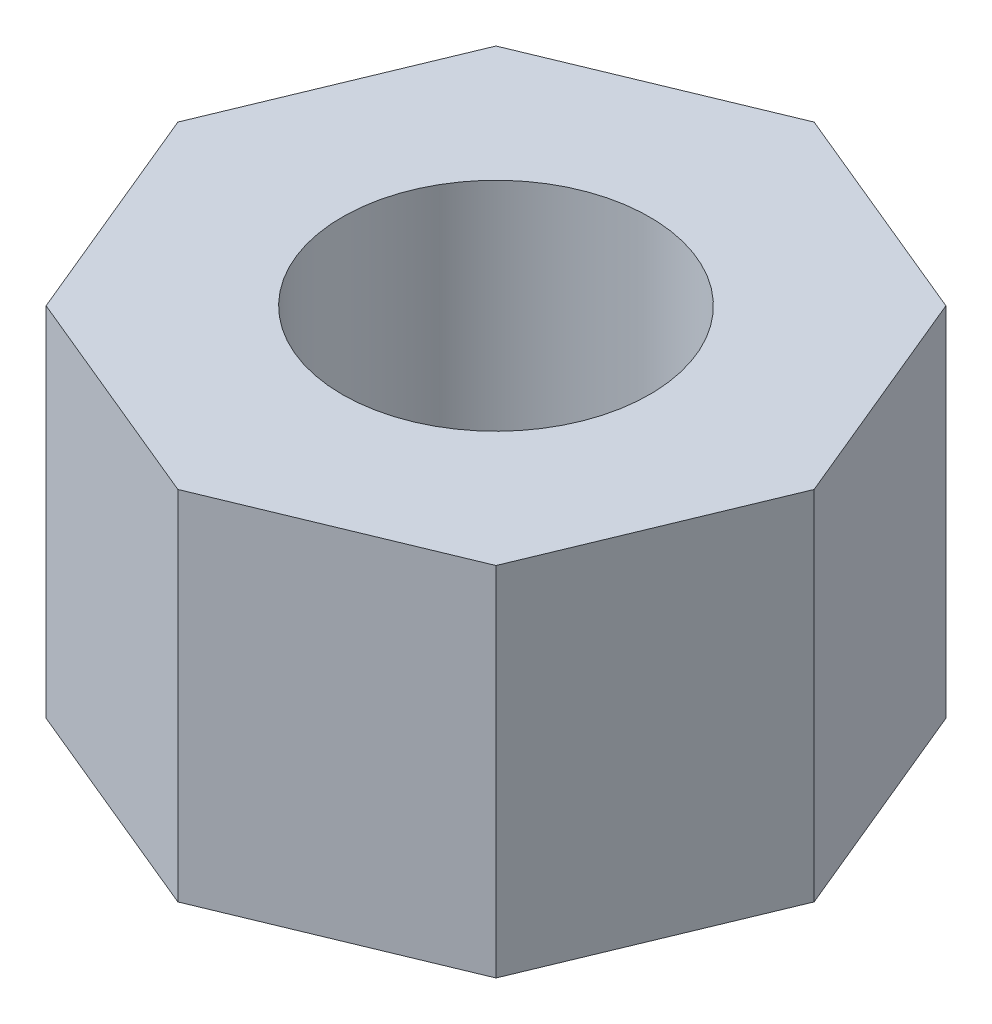
ISO-10303-21;
HEADER;
FILE_DESCRIPTION(('STEP AP214'),'2;1');
FILE_NAME('part.step','',(''),(''),'','','');
FILE_SCHEMA(('AUTOMOTIVE_DESIGN { 1 0 10303 214 1 1 1 1 }'));
ENDSEC;
DATA;
#1=APPLICATION_CONTEXT('core data for automotive mechanical design processes');
#2=APPLICATION_PROTOCOL_DEFINITION('international standard','automotive_design',2000,#1);
#3=PRODUCT_CONTEXT('',#1,'mechanical');
#4=PRODUCT('Part','Part','',(#3));
#5=PRODUCT_RELATED_PRODUCT_CATEGORY('part','',(#4));
#6=PRODUCT_DEFINITION_FORMATION('','',#4);
#7=PRODUCT_DEFINITION_CONTEXT('part definition',#1,'design');
#8=PRODUCT_DEFINITION('design','',#6,#7);
#9=PRODUCT_DEFINITION_SHAPE('','',#8);
#10=(LENGTH_UNIT() NAMED_UNIT(*) SI_UNIT(.MILLI.,.METRE.));
#11=(NAMED_UNIT(*) PLANE_ANGLE_UNIT() SI_UNIT($,.RADIAN.));
#12=(NAMED_UNIT(*) SI_UNIT($,.STERADIAN.) SOLID_ANGLE_UNIT());
#13=UNCERTAINTY_MEASURE_WITH_UNIT(LENGTH_MEASURE(1.E-05),#10,'distance_accuracy_value','');
#14=(GEOMETRIC_REPRESENTATION_CONTEXT(3) GLOBAL_UNCERTAINTY_ASSIGNED_CONTEXT((#13)) GLOBAL_UNIT_ASSIGNED_CONTEXT((#10,
#11,#12)) REPRESENTATION_CONTEXT('',''));
#15=CARTESIAN_POINT('',(0.,0.,0.));
#16=DIRECTION('',(0.,0.,1.));
#17=DIRECTION('',(1.,0.,0.));
#18=AXIS2_PLACEMENT_3D('',#15,#16,#17);
#19=CARTESIAN_POINT('',(2.48744231037308,7.9,6.00521696132337));
#20=DIRECTION('',(-0.38268343236509,0.,-0.923879532511287));
#21=DIRECTION('',(-0.923879532511287,0.,0.38268343236509));
#22=AXIS2_PLACEMENT_3D('',#19,#20,#21);
#23=PLANE('',#22);
#24=DIRECTION('',(0.923879532511287,0.,-0.38268343236509));
#25=VECTOR('',#24,1.);
#26=CARTESIAN_POINT('',(2.48744231037308,0.,6.00521696132337));
#27=LINE('',#26,#25);
#28=CARTESIAN_POINT('',(0.,0.,7.03554930190056));
#29=VERTEX_POINT('',#28);
#30=CARTESIAN_POINT('',(4.97488462074616,0.,4.97488462074617));
#31=VERTEX_POINT('',#30);
#32=EDGE_CURVE('E135',#29,#31,#27,.T.);
#33=ORIENTED_EDGE('',*,*,#32,.T.);
#34=DIRECTION('',(0.,-1.,0.));
#35=VECTOR('',#34,1.);
#36=CARTESIAN_POINT('',(4.97488462074616,7.9,4.97488462074617));
#37=LINE('',#36,#35);
#38=CARTESIAN_POINT('',(4.97488462074616,7.9,4.97488462074617));
#39=VERTEX_POINT('',#38);
#40=EDGE_CURVE('E11',#39,#31,#37,.T.);
#41=ORIENTED_EDGE('',*,*,#40,.F.);
#42=DIRECTION('',(0.923879532511287,0.,-0.38268343236509));
#43=VECTOR('',#42,1.);
#44=CARTESIAN_POINT('',(2.48744231037308,7.9,6.00521696132337));
#45=LINE('',#44,#43);
#46=CARTESIAN_POINT('',(0.,7.9,7.03554930190056));
#47=VERTEX_POINT('',#46);
#48=EDGE_CURVE('E181',#47,#39,#45,.T.);
#49=ORIENTED_EDGE('',*,*,#48,.F.);
#50=DIRECTION('',(0.,-1.,0.));
#51=VECTOR('',#50,1.);
#52=CARTESIAN_POINT('',(0.,7.9,7.03554930190056));
#53=LINE('',#52,#51);
#54=EDGE_CURVE('E128',#47,#29,#53,.T.);
#55=ORIENTED_EDGE('',*,*,#54,.T.);
#56=EDGE_LOOP('',(#33,#41,#49,#55));
#57=FACE_BOUND('',#56,.T.);
#58=ADVANCED_FACE('F35',(#57),#23,.F.);
#59=CARTESIAN_POINT('',(6.00521696132336,7.9,2.48744231037308));
#60=DIRECTION('',(-0.923879532511287,0.,-0.38268343236509));
#61=DIRECTION('',(-0.38268343236509,0.,0.923879532511287));
#62=AXIS2_PLACEMENT_3D('',#59,#60,#61);
#63=PLANE('',#62);
#64=DIRECTION('',(0.38268343236509,0.,-0.923879532511287));
#65=VECTOR('',#64,1.);
#66=CARTESIAN_POINT('',(6.00521696132336,0.,2.48744231037308));
#67=LINE('',#66,#65);
#68=CARTESIAN_POINT('',(7.03554930190056,0.,0.));
#69=VERTEX_POINT('',#68);
#70=EDGE_CURVE('E138',#31,#69,#67,.T.);
#71=ORIENTED_EDGE('',*,*,#70,.T.);
#72=DIRECTION('',(0.,-1.,0.));
#73=VECTOR('',#72,1.);
#74=CARTESIAN_POINT('',(7.03554930190056,7.9,0.));
#75=LINE('',#74,#73);
#76=CARTESIAN_POINT('',(7.03554930190056,7.9,0.));
#77=VERTEX_POINT('',#76);
#78=EDGE_CURVE('E44',#77,#69,#75,.T.);
#79=ORIENTED_EDGE('',*,*,#78,.F.);
#80=DIRECTION('',(0.38268343236509,0.,-0.923879532511287));
#81=VECTOR('',#80,1.);
#82=CARTESIAN_POINT('',(6.00521696132336,7.9,2.48744231037308));
#83=LINE('',#82,#81);
#84=EDGE_CURVE('E95',#39,#77,#83,.T.);
#85=ORIENTED_EDGE('',*,*,#84,.F.);
#86=ORIENTED_EDGE('',*,*,#40,.T.);
#87=EDGE_LOOP('',(#71,#79,#85,#86));
#88=FACE_BOUND('',#87,.T.);
#89=ADVANCED_FACE('F199',(#88),#63,.F.);
#90=CARTESIAN_POINT('',(6.00521696132336,7.9,-2.48744231037308));
#91=DIRECTION('',(-0.923879532511287,0.,0.38268343236509));
#92=DIRECTION('',(0.38268343236509,0.,0.923879532511287));
#93=AXIS2_PLACEMENT_3D('',#90,#91,#92);
#94=PLANE('',#93);
#95=DIRECTION('',(-0.38268343236509,0.,-0.923879532511287));
#96=VECTOR('',#95,1.);
#97=CARTESIAN_POINT('',(6.00521696132336,0.,-2.48744231037308));
#98=LINE('',#97,#96);
#99=CARTESIAN_POINT('',(4.97488462074617,0.,-4.97488462074616));
#100=VERTEX_POINT('',#99);
#101=EDGE_CURVE('E140',#69,#100,#98,.T.);
#102=ORIENTED_EDGE('',*,*,#101,.T.);
#103=DIRECTION('',(0.,-1.,0.));
#104=VECTOR('',#103,1.);
#105=CARTESIAN_POINT('',(4.97488462074617,7.9,-4.97488462074616));
#106=LINE('',#105,#104);
#107=CARTESIAN_POINT('',(4.97488462074617,7.9,-4.97488462074616));
#108=VERTEX_POINT('',#107);
#109=EDGE_CURVE('E156',#108,#100,#106,.T.);
#110=ORIENTED_EDGE('',*,*,#109,.F.);
#111=DIRECTION('',(-0.38268343236509,0.,-0.923879532511287));
#112=VECTOR('',#111,1.);
#113=CARTESIAN_POINT('',(6.00521696132336,7.9,-2.48744231037308));
#114=LINE('',#113,#112);
#115=EDGE_CURVE('E164',#77,#108,#114,.T.);
#116=ORIENTED_EDGE('',*,*,#115,.F.);
#117=ORIENTED_EDGE('',*,*,#78,.T.);
#118=EDGE_LOOP('',(#102,#110,#116,#117));
#119=FACE_BOUND('',#118,.T.);
#120=ADVANCED_FACE('F162',(#119),#94,.F.);
#121=CARTESIAN_POINT('',(2.48744231037304,7.9,-6.00521696132336));
#122=DIRECTION('',(-0.382683432365085,0.,0.923879532511289));
#123=DIRECTION('',(0.923879532511289,0.,0.382683432365085));
#124=AXIS2_PLACEMENT_3D('',#121,#122,#123);
#125=PLANE('',#124);
#126=DIRECTION('',(-0.923879532511289,0.,-0.382683432365085));
#127=VECTOR('',#126,1.);
#128=CARTESIAN_POINT('',(2.48744231037304,0.,-6.00521696132336));
#129=LINE('',#128,#127);
#130=CARTESIAN_POINT('',(0.,0.,-7.03554930190056));
#131=VERTEX_POINT('',#130);
#132=EDGE_CURVE('E142',#100,#131,#129,.T.);
#133=ORIENTED_EDGE('',*,*,#132,.T.);
#134=DIRECTION('',(0.,-1.,0.));
#135=VECTOR('',#134,1.);
#136=CARTESIAN_POINT('',(0.,7.9,-7.03554930190056));
#137=LINE('',#136,#135);
#138=CARTESIAN_POINT('',(0.,7.9,-7.03554930190056));
#139=VERTEX_POINT('',#138);
#140=EDGE_CURVE('E153',#139,#131,#137,.T.);
#141=ORIENTED_EDGE('',*,*,#140,.F.);
#142=DIRECTION('',(-0.923879532511289,0.,-0.382683432365085));
#143=VECTOR('',#142,1.);
#144=CARTESIAN_POINT('',(2.48744231037304,7.9,-6.00521696132336));
#145=LINE('',#144,#143);
#146=EDGE_CURVE('E176',#108,#139,#145,.T.);
#147=ORIENTED_EDGE('',*,*,#146,.F.);
#148=ORIENTED_EDGE('',*,*,#109,.T.);
#149=EDGE_LOOP('',(#133,#141,#147,#148));
#150=FACE_BOUND('',#149,.T.);
#151=ADVANCED_FACE('F172',(#150),#125,.F.);
#152=CARTESIAN_POINT('',(-2.48744231037313,7.9,-6.00521696132336));
#153=DIRECTION('',(0.382683432365097,0.,0.923879532511284));
#154=DIRECTION('',(0.923879532511284,0.,-0.382683432365097));
#155=AXIS2_PLACEMENT_3D('',#152,#153,#154);
#156=PLANE('',#155);
#157=DIRECTION('',(-0.923879532511284,0.,0.382683432365097));
#158=VECTOR('',#157,1.);
#159=CARTESIAN_POINT('',(-2.48744231037313,0.,-6.00521696132336));
#160=LINE('',#159,#158);
#161=CARTESIAN_POINT('',(-4.97488462074616,0.,-4.97488462074616));
#162=VERTEX_POINT('',#161);
#163=EDGE_CURVE('E144',#131,#162,#160,.T.);
#164=ORIENTED_EDGE('',*,*,#163,.T.);
#165=DIRECTION('',(0.,-1.,0.));
#166=VECTOR('',#165,1.);
#167=CARTESIAN_POINT('',(-4.97488462074616,7.9,-4.97488462074616));
#168=LINE('',#167,#166);
#169=CARTESIAN_POINT('',(-4.97488462074616,7.9,-4.97488462074616));
#170=VERTEX_POINT('',#169);
#171=EDGE_CURVE('E123',#170,#162,#168,.T.);
#172=ORIENTED_EDGE('',*,*,#171,.F.);
#173=DIRECTION('',(-0.923879532511284,0.,0.382683432365097));
#174=VECTOR('',#173,1.);
#175=CARTESIAN_POINT('',(-2.48744231037313,7.9,-6.00521696132336));
#176=LINE('',#175,#174);
#177=EDGE_CURVE('E114',#139,#170,#176,.T.);
#178=ORIENTED_EDGE('',*,*,#177,.F.);
#179=ORIENTED_EDGE('',*,*,#140,.T.);
#180=EDGE_LOOP('',(#164,#172,#178,#179));
#181=FACE_BOUND('',#180,.T.);
#182=ADVANCED_FACE('F175',(#181),#156,.F.);
#183=CARTESIAN_POINT('',(-6.00521696132336,7.9,-2.48744231037309));
#184=DIRECTION('',(0.923879532511287,0.,0.38268343236509));
#185=DIRECTION('',(0.38268343236509,0.,-0.923879532511287));
#186=AXIS2_PLACEMENT_3D('',#183,#184,#185);
#187=PLANE('',#186);
#188=DIRECTION('',(-0.38268343236509,0.,0.923879532511287));
#189=VECTOR('',#188,1.);
#190=CARTESIAN_POINT('',(-6.00521696132336,0.,-2.48744231037309));
#191=LINE('',#190,#189);
#192=CARTESIAN_POINT('',(-7.03554930190056,0.,0.));
#193=VERTEX_POINT('',#192);
#194=EDGE_CURVE('E122',#162,#193,#191,.T.);
#195=ORIENTED_EDGE('',*,*,#194,.T.);
#196=DIRECTION('',(0.,-1.,0.));
#197=VECTOR('',#196,1.);
#198=CARTESIAN_POINT('',(-7.03554930190056,7.9,0.));
#199=LINE('',#198,#197);
#200=CARTESIAN_POINT('',(-7.03554930190056,7.9,0.));
#201=VERTEX_POINT('',#200);
#202=EDGE_CURVE('E119',#201,#193,#199,.T.);
#203=ORIENTED_EDGE('',*,*,#202,.F.);
#204=DIRECTION('',(-0.38268343236509,0.,0.923879532511287));
#205=VECTOR('',#204,1.);
#206=CARTESIAN_POINT('',(-6.00521696132336,7.9,-2.48744231037309));
#207=LINE('',#206,#205);
#208=EDGE_CURVE('E108',#170,#201,#207,.T.);
#209=ORIENTED_EDGE('',*,*,#208,.F.);
#210=ORIENTED_EDGE('',*,*,#171,.T.);
#211=EDGE_LOOP('',(#195,#203,#209,#210));
#212=FACE_BOUND('',#211,.T.);
#213=ADVANCED_FACE('F120',(#212),#187,.F.);
#214=CARTESIAN_POINT('',(-6.00521696132337,7.9,2.48744231037308));
#215=DIRECTION('',(0.923879532511287,0.,-0.38268343236509));
#216=DIRECTION('',(-0.38268343236509,0.,-0.923879532511287));
#217=AXIS2_PLACEMENT_3D('',#214,#215,#216);
#218=PLANE('',#217);
#219=DIRECTION('',(0.38268343236509,0.,0.923879532511287));
#220=VECTOR('',#219,1.);
#221=CARTESIAN_POINT('',(-6.00521696132337,0.,2.48744231037308));
#222=LINE('',#221,#220);
#223=CARTESIAN_POINT('',(-4.97488462074617,0.,4.97488462074616));
#224=VERTEX_POINT('',#223);
#225=EDGE_CURVE('E81',#193,#224,#222,.T.);
#226=ORIENTED_EDGE('',*,*,#225,.T.);
#227=DIRECTION('',(0.,-1.,0.));
#228=VECTOR('',#227,1.);
#229=CARTESIAN_POINT('',(-4.97488462074617,7.9,4.97488462074616));
#230=LINE('',#229,#228);
#231=CARTESIAN_POINT('',(-4.97488462074617,7.9,4.97488462074616));
#232=VERTEX_POINT('',#231);
#233=EDGE_CURVE('E124',#232,#224,#230,.T.);
#234=ORIENTED_EDGE('',*,*,#233,.F.);
#235=DIRECTION('',(0.38268343236509,0.,0.923879532511287));
#236=VECTOR('',#235,1.);
#237=CARTESIAN_POINT('',(-6.00521696132337,7.9,2.48744231037308));
#238=LINE('',#237,#236);
#239=EDGE_CURVE('E112',#201,#232,#238,.T.);
#240=ORIENTED_EDGE('',*,*,#239,.F.);
#241=ORIENTED_EDGE('',*,*,#202,.T.);
#242=EDGE_LOOP('',(#226,#234,#240,#241));
#243=FACE_BOUND('',#242,.T.);
#244=ADVANCED_FACE('F126',(#243),#218,.F.);
#245=CARTESIAN_POINT('',(0.,7.9,0.));
#246=DIRECTION('',(0.,-1.,0.));
#247=DIRECTION('',(0.,0.,-1.));
#248=AXIS2_PLACEMENT_3D('',#245,#246,#247);
#249=CYLINDRICAL_SURFACE('',#248,3.4);
#250=CARTESIAN_POINT('',(0.,7.9,0.));
#251=DIRECTION('',(0.,1.,0.));
#252=DIRECTION('',(0.,0.,1.));
#253=AXIS2_PLACEMENT_3D('',#250,#251,#252);
#254=CIRCLE('',#253,3.4);
#255=CARTESIAN_POINT('',(0.,7.9,3.4));
#256=VERTEX_POINT('',#255);
#257=EDGE_CURVE('E149',#256,#256,#254,.T.);
#258=ORIENTED_EDGE('',*,*,#257,.T.);
#259=EDGE_LOOP('',(#258));
#260=FACE_BOUND('',#259,.T.);
#261=CARTESIAN_POINT('',(0.,0.,0.));
#262=DIRECTION('',(0.,1.,0.));
#263=DIRECTION('',(0.,0.,1.));
#264=AXIS2_PLACEMENT_3D('',#261,#262,#263);
#265=CIRCLE('',#264,3.4);
#266=CARTESIAN_POINT('',(0.,0.,3.4));
#267=VERTEX_POINT('',#266);
#268=EDGE_CURVE('E132',#267,#267,#265,.T.);
#269=ORIENTED_EDGE('',*,*,#268,.F.);
#270=EDGE_LOOP('',(#269));
#271=FACE_BOUND('',#270,.T.);
#272=ADVANCED_FACE('F37',(#260,#271),#249,.F.);
#273=CARTESIAN_POINT('',(-2.48744231037308,7.9,6.00521696132336));
#274=DIRECTION('',(0.38268343236509,0.,-0.923879532511287));
#275=DIRECTION('',(-0.923879532511287,0.,-0.38268343236509));
#276=AXIS2_PLACEMENT_3D('',#273,#274,#275);
#277=PLANE('',#276);
#278=DIRECTION('',(0.923879532511287,0.,0.38268343236509));
#279=VECTOR('',#278,1.);
#280=CARTESIAN_POINT('',(-2.48744231037308,0.,6.00521696132336));
#281=LINE('',#280,#279);
#282=EDGE_CURVE('E87',#224,#29,#281,.T.);
#283=ORIENTED_EDGE('',*,*,#282,.T.);
#284=ORIENTED_EDGE('',*,*,#54,.F.);
#285=DIRECTION('',(0.923879532511287,0.,0.38268343236509));
#286=VECTOR('',#285,1.);
#287=CARTESIAN_POINT('',(-2.48744231037308,7.9,6.00521696132336));
#288=LINE('',#287,#286);
#289=EDGE_CURVE('E52',#232,#47,#288,.T.);
#290=ORIENTED_EDGE('',*,*,#289,.F.);
#291=ORIENTED_EDGE('',*,*,#233,.T.);
#292=EDGE_LOOP('',(#283,#284,#290,#291));
#293=FACE_BOUND('',#292,.T.);
#294=ADVANCED_FACE('F189',(#293),#277,.F.);
#295=CARTESIAN_POINT('',(0.,7.9,0.));
#296=DIRECTION('',(0.,1.,0.));
#297=DIRECTION('',(0.,0.,1.));
#298=AXIS2_PLACEMENT_3D('',#295,#296,#297);
#299=PLANE('',#298);
#300=ORIENTED_EDGE('',*,*,#257,.F.);
#301=EDGE_LOOP('',(#300));
#302=FACE_BOUND('',#301,.T.);
#303=ORIENTED_EDGE('',*,*,#48,.T.);
#304=ORIENTED_EDGE('',*,*,#84,.T.);
#305=ORIENTED_EDGE('',*,*,#115,.T.);
#306=ORIENTED_EDGE('',*,*,#146,.T.);
#307=ORIENTED_EDGE('',*,*,#177,.T.);
#308=ORIENTED_EDGE('',*,*,#208,.T.);
#309=ORIENTED_EDGE('',*,*,#239,.T.);
#310=ORIENTED_EDGE('',*,*,#289,.T.);
#311=EDGE_LOOP('',(#303,#304,#305,#306,#307,#308,#309,#310));
#312=FACE_BOUND('',#311,.T.);
#313=ADVANCED_FACE('F110',(#302,#312),#299,.T.);
#314=CARTESIAN_POINT('',(0.,0.,0.));
#315=DIRECTION('',(0.,1.,0.));
#316=DIRECTION('',(0.,0.,1.));
#317=AXIS2_PLACEMENT_3D('',#314,#315,#316);
#318=PLANE('',#317);
#319=ORIENTED_EDGE('',*,*,#268,.T.);
#320=EDGE_LOOP('',(#319));
#321=FACE_BOUND('',#320,.T.);
#322=ORIENTED_EDGE('',*,*,#32,.F.);
#323=ORIENTED_EDGE('',*,*,#282,.F.);
#324=ORIENTED_EDGE('',*,*,#225,.F.);
#325=ORIENTED_EDGE('',*,*,#194,.F.);
#326=ORIENTED_EDGE('',*,*,#163,.F.);
#327=ORIENTED_EDGE('',*,*,#132,.F.);
#328=ORIENTED_EDGE('',*,*,#101,.F.);
#329=ORIENTED_EDGE('',*,*,#70,.F.);
#330=EDGE_LOOP('',(#322,#323,#324,#325,#326,#327,#328,#329));
#331=FACE_BOUND('',#330,.T.);
#332=ADVANCED_FACE('F168',(#321,#331),#318,.F.);
#333=CLOSED_SHELL('',(#58,#89,#120,#151,#182,#213,#244,#272,#294,#313,#332));
#334=MANIFOLD_SOLID_BREP('B2',#333);
#335=ADVANCED_BREP_SHAPE_REPRESENTATION('',(#18,#334),#14);
#336=SHAPE_DEFINITION_REPRESENTATION(#9,#335);
ENDSEC;
END-ISO-10303-21;
